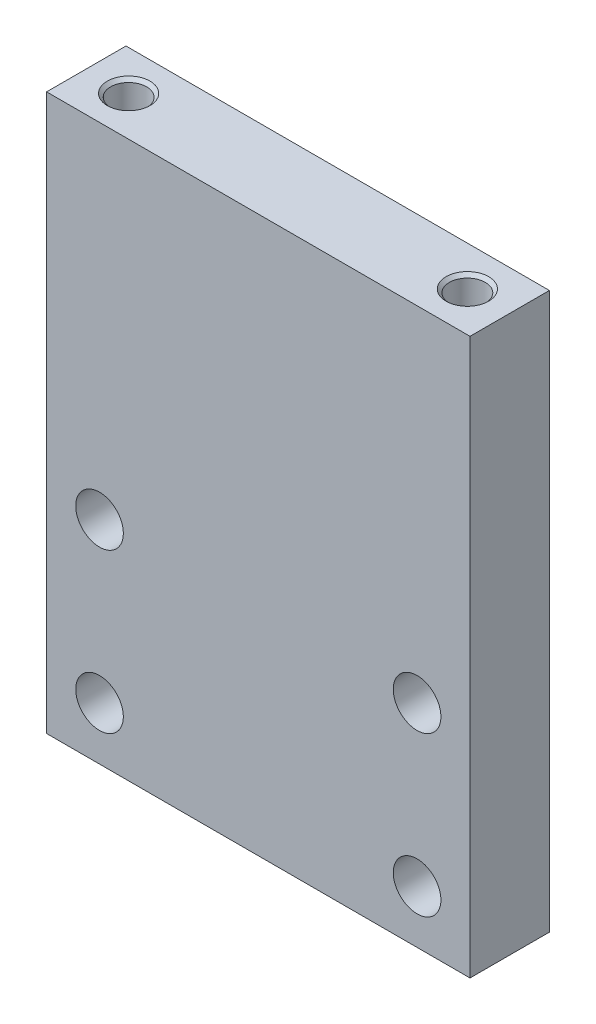
ISO-10303-21;
HEADER;
FILE_DESCRIPTION(('STEP AP214'),'2;1');
FILE_NAME('part.step','',(''),(''),'','','');
FILE_SCHEMA(('AUTOMOTIVE_DESIGN { 1 0 10303 214 1 1 1 1 }'));
ENDSEC;
DATA;
#1=APPLICATION_CONTEXT('core data for automotive mechanical design processes');
#2=APPLICATION_PROTOCOL_DEFINITION('international standard','automotive_design',2000,#1);
#3=PRODUCT_CONTEXT('',#1,'mechanical');
#4=PRODUCT('Part','Part','',(#3));
#5=PRODUCT_RELATED_PRODUCT_CATEGORY('part','',(#4));
#6=PRODUCT_DEFINITION_FORMATION('','',#4);
#7=PRODUCT_DEFINITION_CONTEXT('part definition',#1,'design');
#8=PRODUCT_DEFINITION('design','',#6,#7);
#9=PRODUCT_DEFINITION_SHAPE('','',#8);
#10=(LENGTH_UNIT() NAMED_UNIT(*) SI_UNIT(.MILLI.,.METRE.));
#11=(NAMED_UNIT(*) PLANE_ANGLE_UNIT() SI_UNIT($,.RADIAN.));
#12=(NAMED_UNIT(*) SI_UNIT($,.STERADIAN.) SOLID_ANGLE_UNIT());
#13=UNCERTAINTY_MEASURE_WITH_UNIT(LENGTH_MEASURE(1.E-05),#10,'distance_accuracy_value','');
#14=(GEOMETRIC_REPRESENTATION_CONTEXT(3) GLOBAL_UNCERTAINTY_ASSIGNED_CONTEXT((#13)) GLOBAL_UNIT_ASSIGNED_CONTEXT((#10,
#11,#12)) REPRESENTATION_CONTEXT('',''));
#15=CARTESIAN_POINT('',(0.,0.,0.));
#16=DIRECTION('',(0.,0.,1.));
#17=DIRECTION('',(1.,0.,0.));
#18=AXIS2_PLACEMENT_3D('',#15,#16,#17);
#19=CARTESIAN_POINT('',(0.,0.,15.));
#20=DIRECTION('',(0.,0.,1.));
#21=DIRECTION('',(1.,0.,0.));
#22=AXIS2_PLACEMENT_3D('',#19,#20,#21);
#23=PLANE('',#22);
#24=CARTESIAN_POINT('',(30.,-42.5,15.));
#25=DIRECTION('',(0.,0.,1.));
#26=DIRECTION('',(1.,0.,0.));
#27=AXIS2_PLACEMENT_3D('',#24,#25,#26);
#28=CIRCLE('',#27,4.50000000000001);
#29=CARTESIAN_POINT('',(34.5,-42.5,15.));
#30=VERTEX_POINT('',#29);
#31=EDGE_CURVE('E141',#30,#30,#28,.T.);
#32=ORIENTED_EDGE('',*,*,#31,.F.);
#33=EDGE_LOOP('',(#32));
#34=FACE_BOUND('',#33,.T.);
#35=CARTESIAN_POINT('',(-30.,-12.5,15.));
#36=DIRECTION('',(0.,0.,1.));
#37=DIRECTION('',(1.,0.,0.));
#38=AXIS2_PLACEMENT_3D('',#35,#36,#37);
#39=CIRCLE('',#38,4.5);
#40=CARTESIAN_POINT('',(-25.5,-12.5,15.));
#41=VERTEX_POINT('',#40);
#42=EDGE_CURVE('E157',#41,#41,#39,.T.);
#43=ORIENTED_EDGE('',*,*,#42,.F.);
#44=EDGE_LOOP('',(#43));
#45=FACE_BOUND('',#44,.T.);
#46=DIRECTION('',(0.,1.,0.));
#47=VECTOR('',#46,1.);
#48=CARTESIAN_POINT('',(40.,52.5,15.));
#49=LINE('',#48,#47);
#50=CARTESIAN_POINT('',(40.,-52.5,15.));
#51=VERTEX_POINT('',#50);
#52=CARTESIAN_POINT('',(40.,52.5,15.));
#53=VERTEX_POINT('',#52);
#54=EDGE_CURVE('E165',#51,#53,#49,.T.);
#55=ORIENTED_EDGE('',*,*,#54,.T.);
#56=DIRECTION('',(-1.,0.,0.));
#57=VECTOR('',#56,1.);
#58=CARTESIAN_POINT('',(-40.,52.5,15.));
#59=LINE('',#58,#57);
#60=CARTESIAN_POINT('',(-40.,52.5,15.));
#61=VERTEX_POINT('',#60);
#62=EDGE_CURVE('E94',#53,#61,#59,.T.);
#63=ORIENTED_EDGE('',*,*,#62,.T.);
#64=DIRECTION('',(0.,-1.,0.));
#65=VECTOR('',#64,1.);
#66=CARTESIAN_POINT('',(-40.,52.5,15.));
#67=LINE('',#66,#65);
#68=CARTESIAN_POINT('',(-40.,-52.5,15.));
#69=VERTEX_POINT('',#68);
#70=EDGE_CURVE('E170',#61,#69,#67,.T.);
#71=ORIENTED_EDGE('',*,*,#70,.T.);
#72=DIRECTION('',(1.,0.,0.));
#73=VECTOR('',#72,1.);
#74=CARTESIAN_POINT('',(-40.,-52.5,15.));
#75=LINE('',#74,#73);
#76=EDGE_CURVE('E63',#69,#51,#75,.T.);
#77=ORIENTED_EDGE('',*,*,#76,.T.);
#78=EDGE_LOOP('',(#55,#63,#71,#77));
#79=FACE_BOUND('',#78,.T.);
#80=CARTESIAN_POINT('',(30.,-12.5,15.));
#81=DIRECTION('',(0.,0.,1.));
#82=DIRECTION('',(1.,0.,0.));
#83=AXIS2_PLACEMENT_3D('',#80,#81,#82);
#84=CIRCLE('',#83,4.5);
#85=CARTESIAN_POINT('',(34.5,-12.5,15.));
#86=VERTEX_POINT('',#85);
#87=EDGE_CURVE('E149',#86,#86,#84,.T.);
#88=ORIENTED_EDGE('',*,*,#87,.F.);
#89=EDGE_LOOP('',(#88));
#90=FACE_BOUND('',#89,.T.);
#91=CARTESIAN_POINT('',(-30.,-42.5,15.));
#92=DIRECTION('',(0.,0.,1.));
#93=DIRECTION('',(1.,0.,0.));
#94=AXIS2_PLACEMENT_3D('',#91,#92,#93);
#95=CIRCLE('',#94,4.5);
#96=CARTESIAN_POINT('',(-25.5,-42.5,15.));
#97=VERTEX_POINT('',#96);
#98=EDGE_CURVE('E133',#97,#97,#95,.T.);
#99=ORIENTED_EDGE('',*,*,#98,.F.);
#100=EDGE_LOOP('',(#99));
#101=FACE_BOUND('',#100,.T.);
#102=ADVANCED_FACE('F45',(#34,#45,#79,#90,#101),#23,.T.);
#103=CARTESIAN_POINT('',(0.,0.,0.));
#104=DIRECTION('',(0.,0.,1.));
#105=DIRECTION('',(1.,0.,0.));
#106=AXIS2_PLACEMENT_3D('',#103,#104,#105);
#107=PLANE('',#106);
#108=DIRECTION('',(0.,1.,0.));
#109=VECTOR('',#108,1.);
#110=CARTESIAN_POINT('',(40.,52.5,0.));
#111=LINE('',#110,#109);
#112=CARTESIAN_POINT('',(40.,-52.5,0.));
#113=VERTEX_POINT('',#112);
#114=CARTESIAN_POINT('',(40.,52.5,0.));
#115=VERTEX_POINT('',#114);
#116=EDGE_CURVE('E161',#113,#115,#111,.T.);
#117=ORIENTED_EDGE('',*,*,#116,.F.);
#118=DIRECTION('',(1.,0.,0.));
#119=VECTOR('',#118,1.);
#120=CARTESIAN_POINT('',(-40.,-52.5,0.));
#121=LINE('',#120,#119);
#122=CARTESIAN_POINT('',(-40.,-52.5,0.));
#123=VERTEX_POINT('',#122);
#124=EDGE_CURVE('E87',#123,#113,#121,.T.);
#125=ORIENTED_EDGE('',*,*,#124,.F.);
#126=DIRECTION('',(0.,-1.,0.));
#127=VECTOR('',#126,1.);
#128=CARTESIAN_POINT('',(-40.,52.5,0.));
#129=LINE('',#128,#127);
#130=CARTESIAN_POINT('',(-40.,52.5,0.));
#131=VERTEX_POINT('',#130);
#132=EDGE_CURVE('E81',#131,#123,#129,.T.);
#133=ORIENTED_EDGE('',*,*,#132,.F.);
#134=DIRECTION('',(-1.,0.,0.));
#135=VECTOR('',#134,1.);
#136=CARTESIAN_POINT('',(-40.,52.5,0.));
#137=LINE('',#136,#135);
#138=EDGE_CURVE('E179',#115,#131,#137,.T.);
#139=ORIENTED_EDGE('',*,*,#138,.F.);
#140=EDGE_LOOP('',(#117,#125,#133,#139));
#141=FACE_BOUND('',#140,.T.);
#142=CARTESIAN_POINT('',(-30.,-12.5,0.));
#143=DIRECTION('',(0.,0.,1.));
#144=DIRECTION('',(1.,0.,0.));
#145=AXIS2_PLACEMENT_3D('',#142,#143,#144);
#146=CIRCLE('',#145,4.5);
#147=CARTESIAN_POINT('',(-25.5,-12.5,0.));
#148=VERTEX_POINT('',#147);
#149=EDGE_CURVE('E153',#148,#148,#146,.T.);
#150=ORIENTED_EDGE('',*,*,#149,.T.);
#151=EDGE_LOOP('',(#150));
#152=FACE_BOUND('',#151,.T.);
#153=CARTESIAN_POINT('',(30.,-12.5,0.));
#154=DIRECTION('',(0.,0.,1.));
#155=DIRECTION('',(1.,0.,0.));
#156=AXIS2_PLACEMENT_3D('',#153,#154,#155);
#157=CIRCLE('',#156,4.5);
#158=CARTESIAN_POINT('',(34.5,-12.5,0.));
#159=VERTEX_POINT('',#158);
#160=EDGE_CURVE('E145',#159,#159,#157,.T.);
#161=ORIENTED_EDGE('',*,*,#160,.T.);
#162=EDGE_LOOP('',(#161));
#163=FACE_BOUND('',#162,.T.);
#164=CARTESIAN_POINT('',(30.,-42.5,0.));
#165=DIRECTION('',(0.,0.,1.));
#166=DIRECTION('',(1.,0.,0.));
#167=AXIS2_PLACEMENT_3D('',#164,#165,#166);
#168=CIRCLE('',#167,4.50000000000001);
#169=CARTESIAN_POINT('',(34.5,-42.5,0.));
#170=VERTEX_POINT('',#169);
#171=EDGE_CURVE('E137',#170,#170,#168,.T.);
#172=ORIENTED_EDGE('',*,*,#171,.T.);
#173=EDGE_LOOP('',(#172));
#174=FACE_BOUND('',#173,.T.);
#175=CARTESIAN_POINT('',(-30.,-42.5,0.));
#176=DIRECTION('',(0.,0.,1.));
#177=DIRECTION('',(1.,0.,0.));
#178=AXIS2_PLACEMENT_3D('',#175,#176,#177);
#179=CIRCLE('',#178,4.5);
#180=CARTESIAN_POINT('',(-25.5,-42.5,0.));
#181=VERTEX_POINT('',#180);
#182=EDGE_CURVE('E132',#181,#181,#179,.T.);
#183=ORIENTED_EDGE('',*,*,#182,.T.);
#184=EDGE_LOOP('',(#183));
#185=FACE_BOUND('',#184,.T.);
#186=ADVANCED_FACE('F195',(#141,#152,#163,#174,#185),#107,.F.);
#187=CARTESIAN_POINT('',(40.,52.5,15.));
#188=DIRECTION('',(-1.,0.,0.));
#189=DIRECTION('',(0.,-1.,0.));
#190=AXIS2_PLACEMENT_3D('',#187,#188,#189);
#191=PLANE('',#190);
#192=ORIENTED_EDGE('',*,*,#116,.T.);
#193=DIRECTION('',(0.,0.,-1.));
#194=VECTOR('',#193,1.);
#195=CARTESIAN_POINT('',(40.,52.5,15.));
#196=LINE('',#195,#194);
#197=EDGE_CURVE('E11',#53,#115,#196,.T.);
#198=ORIENTED_EDGE('',*,*,#197,.F.);
#199=ORIENTED_EDGE('',*,*,#54,.F.);
#200=DIRECTION('',(0.,0.,-1.));
#201=VECTOR('',#200,1.);
#202=CARTESIAN_POINT('',(40.,-52.5,15.));
#203=LINE('',#202,#201);
#204=EDGE_CURVE('E175',#51,#113,#203,.T.);
#205=ORIENTED_EDGE('',*,*,#204,.T.);
#206=EDGE_LOOP('',(#192,#198,#199,#205));
#207=FACE_BOUND('',#206,.T.);
#208=ADVANCED_FACE('F47',(#207),#191,.F.);
#209=CARTESIAN_POINT('',(-40.,52.5,15.));
#210=DIRECTION('',(0.,-1.,0.));
#211=DIRECTION('',(0.,0.,-1.));
#212=AXIS2_PLACEMENT_3D('',#209,#210,#211);
#213=PLANE('',#212);
#214=CARTESIAN_POINT('',(-32.,52.5,7.5));
#215=DIRECTION('',(0.,1.,0.));
#216=DIRECTION('',(0.,0.,1.));
#217=AXIS2_PLACEMENT_3D('',#214,#215,#216);
#218=CIRCLE('',#217,4.025);
#219=CARTESIAN_POINT('',(-32.,52.5,11.525));
#220=VERTEX_POINT('',#219);
#221=EDGE_CURVE('E121',#220,#220,#218,.T.);
#222=ORIENTED_EDGE('',*,*,#221,.F.);
#223=EDGE_LOOP('',(#222));
#224=FACE_BOUND('',#223,.T.);
#225=CARTESIAN_POINT('',(32.,52.5,7.49999999999999));
#226=DIRECTION('',(0.,1.,0.));
#227=DIRECTION('',(0.,0.,1.));
#228=AXIS2_PLACEMENT_3D('',#225,#226,#227);
#229=CIRCLE('',#228,4.025);
#230=CARTESIAN_POINT('',(32.,52.5,11.525));
#231=VERTEX_POINT('',#230);
#232=EDGE_CURVE('E112',#231,#231,#229,.T.);
#233=ORIENTED_EDGE('',*,*,#232,.F.);
#234=EDGE_LOOP('',(#233));
#235=FACE_BOUND('',#234,.T.);
#236=ORIENTED_EDGE('',*,*,#138,.T.);
#237=DIRECTION('',(0.,0.,-1.));
#238=VECTOR('',#237,1.);
#239=CARTESIAN_POINT('',(-40.,52.5,15.));
#240=LINE('',#239,#238);
#241=EDGE_CURVE('E55',#61,#131,#240,.T.);
#242=ORIENTED_EDGE('',*,*,#241,.F.);
#243=ORIENTED_EDGE('',*,*,#62,.F.);
#244=ORIENTED_EDGE('',*,*,#197,.T.);
#245=EDGE_LOOP('',(#236,#242,#243,#244));
#246=FACE_BOUND('',#245,.T.);
#247=ADVANCED_FACE('F211',(#224,#235,#246),#213,.F.);
#248=CARTESIAN_POINT('',(-40.,52.5,15.));
#249=DIRECTION('',(1.,0.,0.));
#250=DIRECTION('',(0.,1.,0.));
#251=AXIS2_PLACEMENT_3D('',#248,#249,#250);
#252=PLANE('',#251);
#253=ORIENTED_EDGE('',*,*,#132,.T.);
#254=DIRECTION('',(0.,0.,-1.));
#255=VECTOR('',#254,1.);
#256=CARTESIAN_POINT('',(-40.,-52.5,15.));
#257=LINE('',#256,#255);
#258=EDGE_CURVE('E188',#69,#123,#257,.T.);
#259=ORIENTED_EDGE('',*,*,#258,.F.);
#260=ORIENTED_EDGE('',*,*,#70,.F.);
#261=ORIENTED_EDGE('',*,*,#241,.T.);
#262=EDGE_LOOP('',(#253,#259,#260,#261));
#263=FACE_BOUND('',#262,.T.);
#264=ADVANCED_FACE('F192',(#263),#252,.F.);
#265=CARTESIAN_POINT('',(-40.,-52.5,15.));
#266=DIRECTION('',(0.,1.,0.));
#267=DIRECTION('',(0.,0.,1.));
#268=AXIS2_PLACEMENT_3D('',#265,#266,#267);
#269=PLANE('',#268);
#270=ORIENTED_EDGE('',*,*,#124,.T.);
#271=ORIENTED_EDGE('',*,*,#204,.F.);
#272=ORIENTED_EDGE('',*,*,#76,.F.);
#273=ORIENTED_EDGE('',*,*,#258,.T.);
#274=EDGE_LOOP('',(#270,#271,#272,#273));
#275=FACE_BOUND('',#274,.T.);
#276=ADVANCED_FACE('F200',(#275),#269,.F.);
#277=CARTESIAN_POINT('',(-30.,-12.5,15.));
#278=DIRECTION('',(0.,0.,-1.));
#279=DIRECTION('',(-1.,0.,0.));
#280=AXIS2_PLACEMENT_3D('',#277,#278,#279);
#281=CYLINDRICAL_SURFACE('',#280,4.5);
#282=ORIENTED_EDGE('',*,*,#42,.T.);
#283=EDGE_LOOP('',(#282));
#284=FACE_BOUND('',#283,.T.);
#285=ORIENTED_EDGE('',*,*,#149,.F.);
#286=EDGE_LOOP('',(#285));
#287=FACE_BOUND('',#286,.T.);
#288=ADVANCED_FACE('F202',(#284,#287),#281,.F.);
#289=CARTESIAN_POINT('',(30.,-12.5,15.));
#290=DIRECTION('',(0.,0.,-1.));
#291=DIRECTION('',(-1.,0.,0.));
#292=AXIS2_PLACEMENT_3D('',#289,#290,#291);
#293=CYLINDRICAL_SURFACE('',#292,4.5);
#294=ORIENTED_EDGE('',*,*,#87,.T.);
#295=EDGE_LOOP('',(#294));
#296=FACE_BOUND('',#295,.T.);
#297=ORIENTED_EDGE('',*,*,#160,.F.);
#298=EDGE_LOOP('',(#297));
#299=FACE_BOUND('',#298,.T.);
#300=ADVANCED_FACE('F208',(#296,#299),#293,.F.);
#301=CARTESIAN_POINT('',(30.,-42.5,15.));
#302=DIRECTION('',(0.,0.,-1.));
#303=DIRECTION('',(-1.,0.,0.));
#304=AXIS2_PLACEMENT_3D('',#301,#302,#303);
#305=CYLINDRICAL_SURFACE('',#304,4.50000000000001);
#306=ORIENTED_EDGE('',*,*,#31,.T.);
#307=EDGE_LOOP('',(#306));
#308=FACE_BOUND('',#307,.T.);
#309=ORIENTED_EDGE('',*,*,#171,.F.);
#310=EDGE_LOOP('',(#309));
#311=FACE_BOUND('',#310,.T.);
#312=ADVANCED_FACE('F225',(#308,#311),#305,.F.);
#313=CARTESIAN_POINT('',(-30.,-42.5,15.));
#314=DIRECTION('',(0.,0.,-1.));
#315=DIRECTION('',(-1.,0.,0.));
#316=AXIS2_PLACEMENT_3D('',#313,#314,#315);
#317=CYLINDRICAL_SURFACE('',#316,4.5);
#318=ORIENTED_EDGE('',*,*,#98,.T.);
#319=EDGE_LOOP('',(#318));
#320=FACE_BOUND('',#319,.T.);
#321=ORIENTED_EDGE('',*,*,#182,.F.);
#322=EDGE_LOOP('',(#321));
#323=FACE_BOUND('',#322,.T.);
#324=ADVANCED_FACE('F229',(#320,#323),#317,.F.);
#325=CARTESIAN_POINT('',(32.,30.25,7.49999999999999));
#326=DIRECTION('',(0.,1.,0.));
#327=DIRECTION('',(0.,0.,1.));
#328=AXIS2_PLACEMENT_3D('',#325,#326,#327);
#329=CONICAL_SURFACE('',#328,3.39999999999999,1.02974425867665);
#330=CARTESIAN_POINT('',(32.,28.2070738953063,7.49999999999999));
#331=VERTEX_POINT('',#330);
#332=VERTEX_LOOP('',#331);
#333=FACE_BOUND('',#332,.T.);
#334=CARTESIAN_POINT('',(32.,30.25,7.49999999999999));
#335=DIRECTION('',(0.,1.,0.));
#336=DIRECTION('',(0.,0.,1.));
#337=AXIS2_PLACEMENT_3D('',#334,#335,#336);
#338=CIRCLE('',#337,3.39999999999999);
#339=CARTESIAN_POINT('',(32.,30.25,10.9));
#340=VERTEX_POINT('',#339);
#341=EDGE_CURVE('E128',#340,#340,#338,.T.);
#342=ORIENTED_EDGE('',*,*,#341,.T.);
#343=EDGE_LOOP('',(#342));
#344=FACE_BOUND('',#343,.T.);
#345=ADVANCED_FACE('F233',(#333,#344),#329,.F.);
#346=CARTESIAN_POINT('',(32.,52.5,7.49999999999999));
#347=DIRECTION('',(0.,1.,0.));
#348=DIRECTION('',(0.,0.,1.));
#349=AXIS2_PLACEMENT_3D('',#346,#347,#348);
#350=CYLINDRICAL_SURFACE('',#349,3.4);
#351=ORIENTED_EDGE('',*,*,#341,.F.);
#352=EDGE_LOOP('',(#351));
#353=FACE_BOUND('',#352,.T.);
#354=CARTESIAN_POINT('',(32.,51.875,7.49999999999999));
#355=DIRECTION('',(0.,1.,0.));
#356=DIRECTION('',(0.,0.,1.));
#357=AXIS2_PLACEMENT_3D('',#354,#355,#356);
#358=CIRCLE('',#357,3.4);
#359=CARTESIAN_POINT('',(32.,51.875,10.9));
#360=VERTEX_POINT('',#359);
#361=EDGE_CURVE('E118',#360,#360,#358,.T.);
#362=ORIENTED_EDGE('',*,*,#361,.T.);
#363=EDGE_LOOP('',(#362));
#364=FACE_BOUND('',#363,.T.);
#365=ADVANCED_FACE('F237',(#353,#364),#350,.F.);
#366=CARTESIAN_POINT('',(32.,52.5,7.49999999999999));
#367=DIRECTION('',(0.,1.,0.));
#368=DIRECTION('',(0.,0.,1.));
#369=AXIS2_PLACEMENT_3D('',#366,#367,#368);
#370=CONICAL_SURFACE('',#369,4.025,0.785398163397448);
#371=ORIENTED_EDGE('',*,*,#361,.F.);
#372=EDGE_LOOP('',(#371));
#373=FACE_BOUND('',#372,.T.);
#374=ORIENTED_EDGE('',*,*,#232,.T.);
#375=EDGE_LOOP('',(#374));
#376=FACE_BOUND('',#375,.T.);
#377=ADVANCED_FACE('F105',(#373,#376),#370,.F.);
#378=CARTESIAN_POINT('',(-32.,30.25,7.5));
#379=DIRECTION('',(0.,1.,0.));
#380=DIRECTION('',(0.,0.,1.));
#381=AXIS2_PLACEMENT_3D('',#378,#379,#380);
#382=CONICAL_SURFACE('',#381,3.39999999999999,1.02974425867665);
#383=CARTESIAN_POINT('',(-32.,28.2070738953063,7.5));
#384=VERTEX_POINT('',#383);
#385=VERTEX_LOOP('',#384);
#386=FACE_BOUND('',#385,.T.);
#387=CARTESIAN_POINT('',(-32.,30.25,7.5));
#388=DIRECTION('',(0.,1.,0.));
#389=DIRECTION('',(0.,0.,1.));
#390=AXIS2_PLACEMENT_3D('',#387,#388,#389);
#391=CIRCLE('',#390,3.39999999999999);
#392=CARTESIAN_POINT('',(-32.,30.25,10.9));
#393=VERTEX_POINT('',#392);
#394=EDGE_CURVE('E109',#393,#393,#391,.T.);
#395=ORIENTED_EDGE('',*,*,#394,.T.);
#396=EDGE_LOOP('',(#395));
#397=FACE_BOUND('',#396,.T.);
#398=ADVANCED_FACE('F101',(#386,#397),#382,.F.);
#399=CARTESIAN_POINT('',(-32.,52.5,7.5));
#400=DIRECTION('',(0.,1.,0.));
#401=DIRECTION('',(0.,0.,1.));
#402=AXIS2_PLACEMENT_3D('',#399,#400,#401);
#403=CYLINDRICAL_SURFACE('',#402,3.4);
#404=ORIENTED_EDGE('',*,*,#394,.F.);
#405=EDGE_LOOP('',(#404));
#406=FACE_BOUND('',#405,.T.);
#407=CARTESIAN_POINT('',(-32.,51.875,7.5));
#408=DIRECTION('',(0.,1.,0.));
#409=DIRECTION('',(0.,0.,1.));
#410=AXIS2_PLACEMENT_3D('',#407,#408,#409);
#411=CIRCLE('',#410,3.4);
#412=CARTESIAN_POINT('',(-32.,51.875,10.9));
#413=VERTEX_POINT('',#412);
#414=EDGE_CURVE('E113',#413,#413,#411,.T.);
#415=ORIENTED_EDGE('',*,*,#414,.T.);
#416=EDGE_LOOP('',(#415));
#417=FACE_BOUND('',#416,.T.);
#418=ADVANCED_FACE('F104',(#406,#417),#403,.F.);
#419=CARTESIAN_POINT('',(-32.,52.5,7.5));
#420=DIRECTION('',(0.,1.,0.));
#421=DIRECTION('',(0.,0.,1.));
#422=AXIS2_PLACEMENT_3D('',#419,#420,#421);
#423=CONICAL_SURFACE('',#422,4.025,0.785398163397451);
#424=ORIENTED_EDGE('',*,*,#414,.F.);
#425=EDGE_LOOP('',(#424));
#426=FACE_BOUND('',#425,.T.);
#427=ORIENTED_EDGE('',*,*,#221,.T.);
#428=EDGE_LOOP('',(#427));
#429=FACE_BOUND('',#428,.T.);
#430=ADVANCED_FACE('F247',(#426,#429),#423,.F.);
#431=CLOSED_SHELL('',(#102,#186,#208,#247,#264,#276,#288,#300,#312,#324,#345,#365,#377,#398,
#418,#430));
#432=MANIFOLD_SOLID_BREP('B2',#431);
#433=ADVANCED_BREP_SHAPE_REPRESENTATION('',(#18,#432),#14);
#434=SHAPE_DEFINITION_REPRESENTATION(#9,#433);
ENDSEC;
END-ISO-10303-21;
